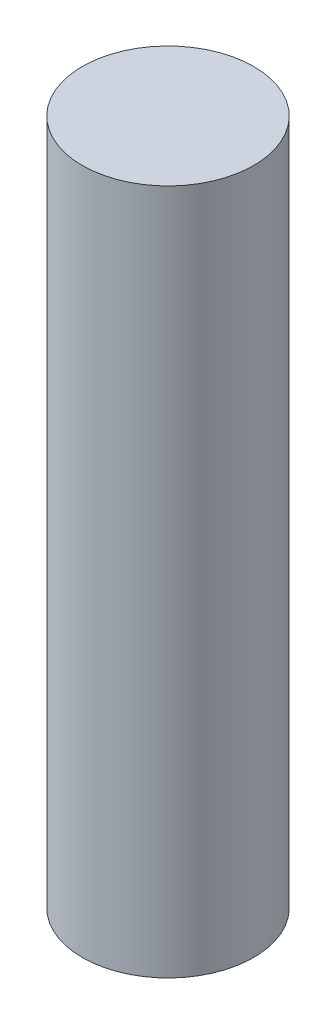
ISO-10303-21;
HEADER;
FILE_DESCRIPTION(('STEP AP214'),'2;1');
FILE_NAME('part.step','',(''),(''),'','','');
FILE_SCHEMA(('AUTOMOTIVE_DESIGN { 1 0 10303 214 1 1 1 1 }'));
ENDSEC;
DATA;
#1=APPLICATION_CONTEXT('core data for automotive mechanical design processes');
#2=APPLICATION_PROTOCOL_DEFINITION('international standard','automotive_design',2000,#1);
#3=PRODUCT_CONTEXT('',#1,'mechanical');
#4=PRODUCT('Part','Part','',(#3));
#5=PRODUCT_RELATED_PRODUCT_CATEGORY('part','',(#4));
#6=PRODUCT_DEFINITION_FORMATION('','',#4);
#7=PRODUCT_DEFINITION_CONTEXT('part definition',#1,'design');
#8=PRODUCT_DEFINITION('design','',#6,#7);
#9=PRODUCT_DEFINITION_SHAPE('','',#8);
#10=(LENGTH_UNIT() NAMED_UNIT(*) SI_UNIT(.MILLI.,.METRE.));
#11=(NAMED_UNIT(*) PLANE_ANGLE_UNIT() SI_UNIT($,.RADIAN.));
#12=(NAMED_UNIT(*) SI_UNIT($,.STERADIAN.) SOLID_ANGLE_UNIT());
#13=UNCERTAINTY_MEASURE_WITH_UNIT(LENGTH_MEASURE(1.E-05),#10,'distance_accuracy_value','');
#14=(GEOMETRIC_REPRESENTATION_CONTEXT(3) GLOBAL_UNCERTAINTY_ASSIGNED_CONTEXT((#13)) GLOBAL_UNIT_ASSIGNED_CONTEXT((#10,
#11,#12)) REPRESENTATION_CONTEXT('',''));
#15=CARTESIAN_POINT('',(0.,0.,0.));
#16=DIRECTION('',(0.,0.,1.));
#17=DIRECTION('',(1.,0.,0.));
#18=AXIS2_PLACEMENT_3D('',#15,#16,#17);
#19=CARTESIAN_POINT('',(0.,127.,0.));
#20=DIRECTION('',(0.,-1.,0.));
#21=DIRECTION('',(0.,0.,-1.));
#22=AXIS2_PLACEMENT_3D('',#19,#20,#21);
#23=CYLINDRICAL_SURFACE('',#22,15.875);
#24=CARTESIAN_POINT('',(0.,127.,0.));
#25=DIRECTION('',(0.,1.,0.));
#26=DIRECTION('',(0.,0.,1.));
#27=AXIS2_PLACEMENT_3D('',#24,#25,#26);
#28=CIRCLE('',#27,15.875);
#29=CARTESIAN_POINT('',(0.,127.,15.875));
#30=VERTEX_POINT('',#29);
#31=EDGE_CURVE('E10',#30,#30,#28,.T.);
#32=ORIENTED_EDGE('',*,*,#31,.F.);
#33=EDGE_LOOP('',(#32));
#34=FACE_BOUND('',#33,.T.);
#35=CARTESIAN_POINT('',(0.,0.,0.));
#36=DIRECTION('',(0.,1.,0.));
#37=DIRECTION('',(0.,0.,1.));
#38=AXIS2_PLACEMENT_3D('',#35,#36,#37);
#39=CIRCLE('',#38,15.875);
#40=CARTESIAN_POINT('',(0.,0.,15.875));
#41=VERTEX_POINT('',#40);
#42=EDGE_CURVE('E40',#41,#41,#39,.T.);
#43=ORIENTED_EDGE('',*,*,#42,.T.);
#44=EDGE_LOOP('',(#43));
#45=FACE_BOUND('',#44,.T.);
#46=ADVANCED_FACE('F37',(#34,#45),#23,.T.);
#47=CARTESIAN_POINT('',(0.,127.,0.));
#48=DIRECTION('',(0.,1.,0.));
#49=DIRECTION('',(0.,0.,1.));
#50=AXIS2_PLACEMENT_3D('',#47,#48,#49);
#51=PLANE('',#50);
#52=ORIENTED_EDGE('',*,*,#31,.T.);
#53=EDGE_LOOP('',(#52));
#54=FACE_BOUND('',#53,.T.);
#55=ADVANCED_FACE('F54',(#54),#51,.T.);
#56=CARTESIAN_POINT('',(0.,0.,0.));
#57=DIRECTION('',(0.,1.,0.));
#58=DIRECTION('',(0.,0.,1.));
#59=AXIS2_PLACEMENT_3D('',#56,#57,#58);
#60=PLANE('',#59);
#61=ORIENTED_EDGE('',*,*,#42,.F.);
#62=EDGE_LOOP('',(#61));
#63=FACE_BOUND('',#62,.T.);
#64=ADVANCED_FACE('F52',(#63),#60,.F.);
#65=CLOSED_SHELL('',(#46,#55,#64));
#66=MANIFOLD_SOLID_BREP('B2',#65);
#67=ADVANCED_BREP_SHAPE_REPRESENTATION('',(#18,#66),#14);
#68=SHAPE_DEFINITION_REPRESENTATION(#9,#67);
ENDSEC;
END-ISO-10303-21;
